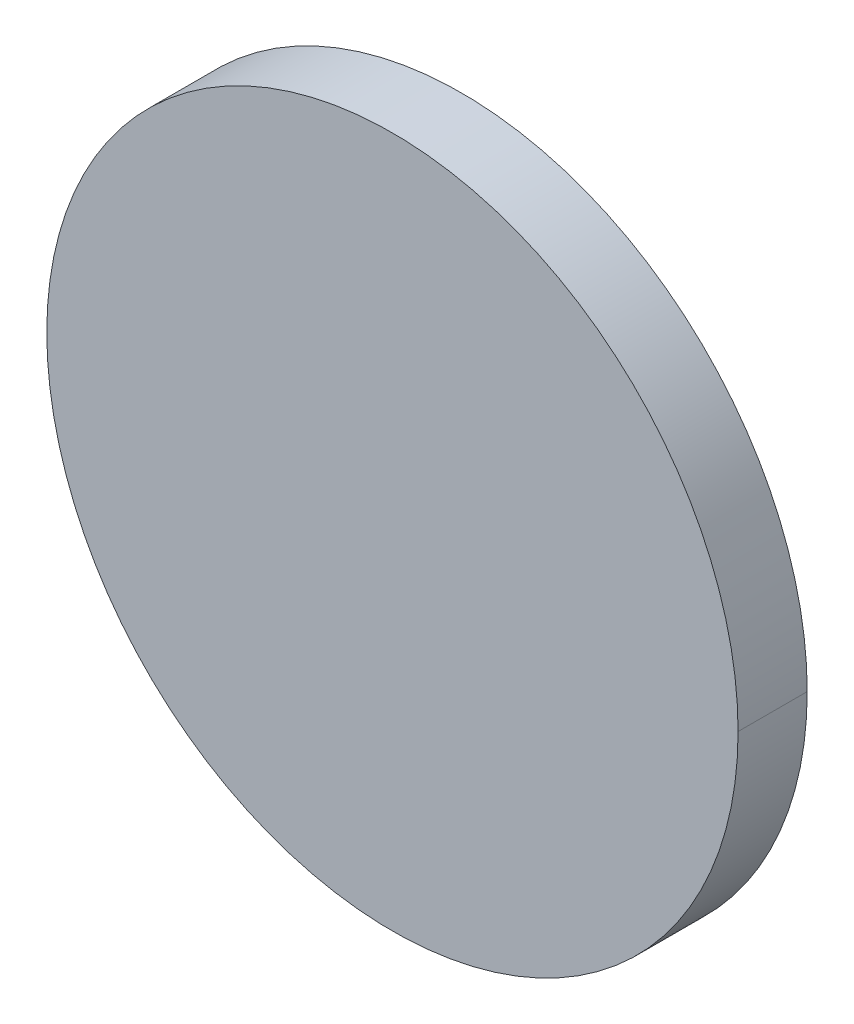
ISO-10303-21;
HEADER;
FILE_DESCRIPTION(('STEP AP214'),'2;1');
FILE_NAME('part.step','',(''),(''),'','','');
FILE_SCHEMA(('AUTOMOTIVE_DESIGN { 1 0 10303 214 1 1 1 1 }'));
ENDSEC;
DATA;
#1=APPLICATION_CONTEXT('core data for automotive mechanical design processes');
#2=APPLICATION_PROTOCOL_DEFINITION('international standard','automotive_design',2000,#1);
#3=PRODUCT_CONTEXT('',#1,'mechanical');
#4=PRODUCT('Part','Part','',(#3));
#5=PRODUCT_RELATED_PRODUCT_CATEGORY('part','',(#4));
#6=PRODUCT_DEFINITION_FORMATION('','',#4);
#7=PRODUCT_DEFINITION_CONTEXT('part definition',#1,'design');
#8=PRODUCT_DEFINITION('design','',#6,#7);
#9=PRODUCT_DEFINITION_SHAPE('','',#8);
#10=(LENGTH_UNIT() NAMED_UNIT(*) SI_UNIT(.MILLI.,.METRE.));
#11=(NAMED_UNIT(*) PLANE_ANGLE_UNIT() SI_UNIT($,.RADIAN.));
#12=(NAMED_UNIT(*) SI_UNIT($,.STERADIAN.) SOLID_ANGLE_UNIT());
#13=UNCERTAINTY_MEASURE_WITH_UNIT(LENGTH_MEASURE(1.E-05),#10,'distance_accuracy_value','');
#14=(GEOMETRIC_REPRESENTATION_CONTEXT(3) GLOBAL_UNCERTAINTY_ASSIGNED_CONTEXT((#13)) GLOBAL_UNIT_ASSIGNED_CONTEXT((#10,
#11,#12)) REPRESENTATION_CONTEXT('',''));
#15=CARTESIAN_POINT('',(0.,0.,0.));
#16=DIRECTION('',(0.,0.,1.));
#17=DIRECTION('',(1.,0.,0.));
#18=AXIS2_PLACEMENT_3D('',#15,#16,#17);
#19=CARTESIAN_POINT('',(0.,0.,0.01));
#20=DIRECTION('',(0.,0.,-1.));
#21=DIRECTION('',(-1.,0.,0.));
#22=AXIS2_PLACEMENT_3D('',#19,#20,#21);
#23=CYLINDRICAL_SURFACE('',#22,0.05);
#24=CARTESIAN_POINT('',(0.,0.,0.01));
#25=DIRECTION('',(0.,0.,1.));
#26=DIRECTION('',(1.,0.,0.));
#27=AXIS2_PLACEMENT_3D('',#24,#25,#26);
#28=CIRCLE('',#27,0.05);
#29=CARTESIAN_POINT('',(0.05,0.,0.01));
#30=VERTEX_POINT('',#29);
#31=CARTESIAN_POINT('',(-0.05,0.,0.01));
#32=VERTEX_POINT('',#31);
#33=EDGE_CURVE('E11',#30,#32,#28,.T.);
#34=ORIENTED_EDGE('',*,*,#33,.F.);
#35=DIRECTION('',(0.,0.,-1.));
#36=VECTOR('',#35,1.);
#37=CARTESIAN_POINT('',(0.05,0.,0.01));
#38=LINE('',#37,#36);
#39=CARTESIAN_POINT('',(0.05,0.,0.));
#40=VERTEX_POINT('',#39);
#41=EDGE_CURVE('E24',#30,#40,#38,.T.);
#42=ORIENTED_EDGE('',*,*,#41,.T.);
#43=CARTESIAN_POINT('',(0.,0.,0.));
#44=DIRECTION('',(0.,0.,1.));
#45=DIRECTION('',(1.,0.,0.));
#46=AXIS2_PLACEMENT_3D('',#43,#44,#45);
#47=CIRCLE('',#46,0.05);
#48=CARTESIAN_POINT('',(-0.05,0.,0.));
#49=VERTEX_POINT('',#48);
#50=EDGE_CURVE('E39',#40,#49,#47,.T.);
#51=ORIENTED_EDGE('',*,*,#50,.T.);
#52=DIRECTION('',(0.,0.,-1.));
#53=VECTOR('',#52,1.);
#54=CARTESIAN_POINT('',(-0.05,0.,0.01));
#55=LINE('',#54,#53);
#56=EDGE_CURVE('E41',#32,#49,#55,.T.);
#57=ORIENTED_EDGE('',*,*,#56,.F.);
#58=EDGE_LOOP('',(#34,#42,#51,#57));
#59=FACE_BOUND('',#58,.T.);
#60=ADVANCED_FACE('F17',(#59),#23,.T.);
#61=CARTESIAN_POINT('',(0.,0.,0.01));
#62=DIRECTION('',(0.,0.,-1.));
#63=DIRECTION('',(-1.,0.,0.));
#64=AXIS2_PLACEMENT_3D('',#61,#62,#63);
#65=CYLINDRICAL_SURFACE('',#64,0.05);
#66=ORIENTED_EDGE('',*,*,#41,.F.);
#67=CARTESIAN_POINT('',(0.,0.,0.01));
#68=DIRECTION('',(0.,0.,1.));
#69=DIRECTION('',(1.,0.,0.));
#70=AXIS2_PLACEMENT_3D('',#67,#68,#69);
#71=CIRCLE('',#70,0.05);
#72=EDGE_CURVE('E50',#32,#30,#71,.T.);
#73=ORIENTED_EDGE('',*,*,#72,.F.);
#74=ORIENTED_EDGE('',*,*,#56,.T.);
#75=CARTESIAN_POINT('',(0.,0.,0.));
#76=DIRECTION('',(0.,0.,1.));
#77=DIRECTION('',(1.,0.,0.));
#78=AXIS2_PLACEMENT_3D('',#75,#76,#77);
#79=CIRCLE('',#78,0.05);
#80=EDGE_CURVE('E49',#49,#40,#79,.T.);
#81=ORIENTED_EDGE('',*,*,#80,.T.);
#82=EDGE_LOOP('',(#66,#73,#74,#81));
#83=FACE_BOUND('',#82,.T.);
#84=ADVANCED_FACE('F48',(#83),#65,.T.);
#85=CARTESIAN_POINT('',(0.,0.,0.01));
#86=DIRECTION('',(0.,0.,1.));
#87=DIRECTION('',(1.,0.,0.));
#88=AXIS2_PLACEMENT_3D('',#85,#86,#87);
#89=PLANE('',#88);
#90=ORIENTED_EDGE('',*,*,#72,.T.);
#91=ORIENTED_EDGE('',*,*,#33,.T.);
#92=EDGE_LOOP('',(#90,#91));
#93=FACE_BOUND('',#92,.T.);
#94=ADVANCED_FACE('F55',(#93),#89,.T.);
#95=CARTESIAN_POINT('',(0.,0.,0.));
#96=DIRECTION('',(0.,0.,1.));
#97=DIRECTION('',(1.,0.,0.));
#98=AXIS2_PLACEMENT_3D('',#95,#96,#97);
#99=PLANE('',#98);
#100=ORIENTED_EDGE('',*,*,#80,.F.);
#101=ORIENTED_EDGE('',*,*,#50,.F.);
#102=EDGE_LOOP('',(#100,#101));
#103=FACE_BOUND('',#102,.T.);
#104=ADVANCED_FACE('F52',(#103),#99,.F.);
#105=CLOSED_SHELL('',(#60,#84,#94,#104));
#106=MANIFOLD_SOLID_BREP('B1',#105);
#107=ADVANCED_BREP_SHAPE_REPRESENTATION('',(#18,#106),#14);
#108=SHAPE_DEFINITION_REPRESENTATION(#9,#107);
ENDSEC;
END-ISO-10303-21;
